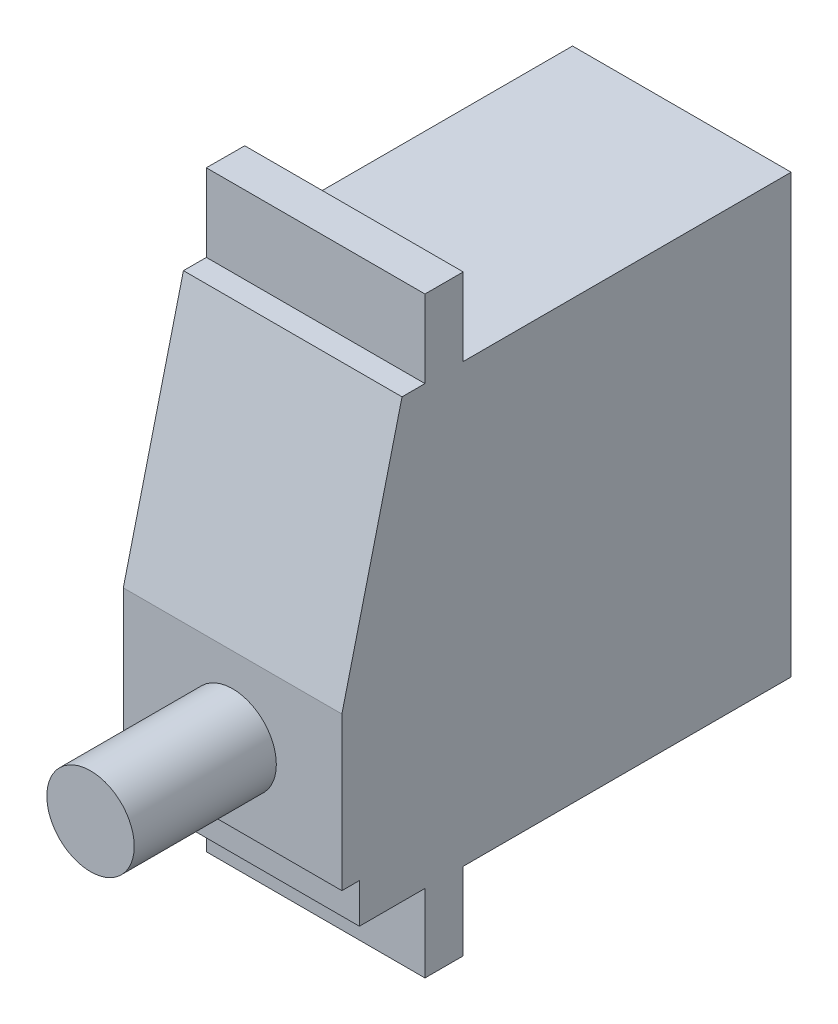
ISO-10303-21;
HEADER;
FILE_DESCRIPTION(('STEP AP214'),'2;1');
FILE_NAME('part.step','',(''),(''),'','','');
FILE_SCHEMA(('AUTOMOTIVE_DESIGN { 1 0 10303 214 1 1 1 1 }'));
ENDSEC;
DATA;
#1=APPLICATION_CONTEXT('core data for automotive mechanical design processes');
#2=APPLICATION_PROTOCOL_DEFINITION('international standard','automotive_design',2000,#1);
#3=PRODUCT_CONTEXT('',#1,'mechanical');
#4=PRODUCT('Part','Part','',(#3));
#5=PRODUCT_RELATED_PRODUCT_CATEGORY('part','',(#4));
#6=PRODUCT_DEFINITION_FORMATION('','',#4);
#7=PRODUCT_DEFINITION_CONTEXT('part definition',#1,'design');
#8=PRODUCT_DEFINITION('design','',#6,#7);
#9=PRODUCT_DEFINITION_SHAPE('','',#8);
#10=(LENGTH_UNIT() NAMED_UNIT(*) SI_UNIT(.MILLI.,.METRE.));
#11=(NAMED_UNIT(*) PLANE_ANGLE_UNIT() SI_UNIT($,.RADIAN.));
#12=(NAMED_UNIT(*) SI_UNIT($,.STERADIAN.) SOLID_ANGLE_UNIT());
#13=UNCERTAINTY_MEASURE_WITH_UNIT(LENGTH_MEASURE(1.E-05),#10,'distance_accuracy_value','');
#14=(GEOMETRIC_REPRESENTATION_CONTEXT(3) GLOBAL_UNCERTAINTY_ASSIGNED_CONTEXT((#13)) GLOBAL_UNIT_ASSIGNED_CONTEXT((#10,
#11,#12)) REPRESENTATION_CONTEXT('',''));
#15=CARTESIAN_POINT('',(0.,0.,0.));
#16=DIRECTION('',(0.,0.,1.));
#17=DIRECTION('',(1.,0.,0.));
#18=AXIS2_PLACEMENT_3D('',#15,#16,#17);
#19=CARTESIAN_POINT('',(-9.99999955296516,29.3791089206934,0.));
#20=DIRECTION('',(0.,1.,0.));
#21=DIRECTION('',(0.,0.,1.));
#22=AXIS2_PLACEMENT_3D('',#19,#20,#21);
#23=PLANE('',#22);
#24=DIRECTION('',(0.,0.,1.));
#25=VECTOR('',#24,1.);
#26=CARTESIAN_POINT('',(-9.99999955296516,29.3791089206934,0.));
#27=LINE('',#26,#25);
#28=CARTESIAN_POINT('',(-9.99999955296516,29.3791089206934,0.));
#29=VERTEX_POINT('',#28);
#30=CARTESIAN_POINT('',(-9.99999955296518,29.3791089206934,32.225966149538));
#31=VERTEX_POINT('',#30);
#32=EDGE_CURVE('E169',#29,#31,#27,.T.);
#33=ORIENTED_EDGE('',*,*,#32,.T.);
#34=DIRECTION('',(0.00392855270652036,0.,-0.999992283207042));
#35=VECTOR('',#34,1.);
#36=CARTESIAN_POINT('',(-10.0051267672293,29.3791089206934,33.5310713833168));
#37=LINE('',#36,#35);
#38=CARTESIAN_POINT('',(-9.99125465750694,29.3791089206934,29.9999993294477));
#39=VERTEX_POINT('',#38);
#40=EDGE_CURVE('E152',#31,#39,#37,.T.);
#41=ORIENTED_EDGE('',*,*,#40,.T.);
#42=DIRECTION('',(1.,0.,0.));
#43=VECTOR('',#42,1.);
#44=CARTESIAN_POINT('',(-17.9139704070891,29.3791089206934,29.9999993294477));
#45=LINE('',#44,#43);
#46=CARTESIAN_POINT('',(10.,29.3791089206934,29.9999993294477));
#47=VERTEX_POINT('',#46);
#48=EDGE_CURVE('E158',#39,#47,#45,.T.);
#49=ORIENTED_EDGE('',*,*,#48,.T.);
#50=DIRECTION('',(0.,0.,1.));
#51=VECTOR('',#50,1.);
#52=CARTESIAN_POINT('',(10.,29.3791089206934,0.));
#53=LINE('',#52,#51);
#54=CARTESIAN_POINT('',(10.,29.3791089206934,0.));
#55=VERTEX_POINT('',#54);
#56=EDGE_CURVE('E233',#55,#47,#53,.T.);
#57=ORIENTED_EDGE('',*,*,#56,.F.);
#58=DIRECTION('',(1.,0.,0.));
#59=VECTOR('',#58,1.);
#60=CARTESIAN_POINT('',(-9.99999955296516,29.3791089206934,0.));
#61=LINE('',#60,#59);
#62=EDGE_CURVE('E238',#29,#55,#61,.T.);
#63=ORIENTED_EDGE('',*,*,#62,.F.);
#64=EDGE_LOOP('',(#33,#41,#49,#57,#63));
#65=FACE_BOUND('',#64,.T.);
#66=ADVANCED_FACE('F34',(#65),#23,.T.);
#67=CARTESIAN_POINT('',(-9.99999955296516,-17.720889300108,0.));
#68=DIRECTION('',(0.,0.,-1.));
#69=DIRECTION('',(0.,1.,0.));
#70=AXIS2_PLACEMENT_3D('',#67,#68,#69);
#71=PLANE('',#70);
#72=DIRECTION('',(1.,0.,0.));
#73=VECTOR('',#72,1.);
#74=CARTESIAN_POINT('',(-9.99999955296516,-10.6208901852369,0.));
#75=LINE('',#74,#73);
#76=CARTESIAN_POINT('',(-9.99999955296516,-10.6208901852369,0.));
#77=VERTEX_POINT('',#76);
#78=CARTESIAN_POINT('',(10.,-10.6208901852369,0.));
#79=VERTEX_POINT('',#78);
#80=EDGE_CURVE('E255',#77,#79,#75,.T.);
#81=ORIENTED_EDGE('',*,*,#80,.F.);
#82=DIRECTION('',(0.,1.,0.));
#83=VECTOR('',#82,1.);
#84=CARTESIAN_POINT('',(-9.99999955296516,-17.720889300108,0.));
#85=LINE('',#84,#83);
#86=EDGE_CURVE('E231',#77,#29,#85,.T.);
#87=ORIENTED_EDGE('',*,*,#86,.T.);
#88=ORIENTED_EDGE('',*,*,#62,.T.);
#89=DIRECTION('',(0.,1.,0.));
#90=VECTOR('',#89,1.);
#91=CARTESIAN_POINT('',(10.,-17.720889300108,0.));
#92=LINE('',#91,#90);
#93=EDGE_CURVE('E253',#79,#55,#92,.T.);
#94=ORIENTED_EDGE('',*,*,#93,.F.);
#95=EDGE_LOOP('',(#81,#87,#88,#94));
#96=FACE_BOUND('',#95,.T.);
#97=ADVANCED_FACE('F333',(#96),#71,.T.);
#98=CARTESIAN_POINT('',(-9.99999955296516,-17.720889300108,41.0999990999699));
#99=DIRECTION('',(0.,-1.,0.));
#100=DIRECTION('',(0.,0.,-1.));
#101=AXIS2_PLACEMENT_3D('',#98,#99,#100);
#102=PLANE('',#101);
#103=DIRECTION('',(1.,0.,0.));
#104=VECTOR('',#103,1.);
#105=CARTESIAN_POINT('',(-9.99999955296516,-17.720889300108,33.500000834465));
#106=LINE('',#105,#104);
#107=CARTESIAN_POINT('',(-9.99999955296516,-17.720889300108,33.500000834465));
#108=VERTEX_POINT('',#107);
#109=CARTESIAN_POINT('',(10.,-17.720889300108,33.500000834465));
#110=VERTEX_POINT('',#109);
#111=EDGE_CURVE('E289',#108,#110,#106,.T.);
#112=ORIENTED_EDGE('',*,*,#111,.F.);
#113=DIRECTION('',(0.,0.,-1.));
#114=VECTOR('',#113,1.);
#115=CARTESIAN_POINT('',(-9.99999955296516,-17.720889300108,41.0999990999699));
#116=LINE('',#115,#114);
#117=CARTESIAN_POINT('',(-9.99999955296516,-17.720889300108,29.9999993294477));
#118=VERTEX_POINT('',#117);
#119=EDGE_CURVE('E240',#108,#118,#116,.T.);
#120=ORIENTED_EDGE('',*,*,#119,.T.);
#121=DIRECTION('',(1.,0.,0.));
#122=VECTOR('',#121,1.);
#123=CARTESIAN_POINT('',(-9.99999955296516,-17.720889300108,29.9999993294477));
#124=LINE('',#123,#122);
#125=CARTESIAN_POINT('',(10.,-17.720889300108,29.9999993294477));
#126=VERTEX_POINT('',#125);
#127=EDGE_CURVE('E306',#118,#126,#124,.T.);
#128=ORIENTED_EDGE('',*,*,#127,.T.);
#129=DIRECTION('',(0.,0.,-1.));
#130=VECTOR('',#129,1.);
#131=CARTESIAN_POINT('',(10.,-17.720889300108,41.0999990999699));
#132=LINE('',#131,#130);
#133=EDGE_CURVE('E229',#110,#126,#132,.T.);
#134=ORIENTED_EDGE('',*,*,#133,.F.);
#135=EDGE_LOOP('',(#112,#120,#128,#134));
#136=FACE_BOUND('',#135,.T.);
#137=ADVANCED_FACE('F206',(#136),#102,.T.);
#138=CARTESIAN_POINT('',(-9.99999955296516,7.00000021606684,41.0999990999699));
#139=DIRECTION('',(0.,0.,1.));
#140=DIRECTION('',(1.,0.,0.));
#141=AXIS2_PLACEMENT_3D('',#138,#139,#140);
#142=PLANE('',#141);
#143=CARTESIAN_POINT('',(0.,0.,41.0999990999699));
#144=DIRECTION('',(0.,0.,1.));
#145=DIRECTION('',(1.,0.,0.));
#146=AXIS2_PLACEMENT_3D('',#143,#144,#145);
#147=CIRCLE('',#146,4.);
#148=CARTESIAN_POINT('',(4.,0.,41.0999990999699));
#149=VERTEX_POINT('',#148);
#150=EDGE_CURVE('E12',#149,#149,#147,.T.);
#151=ORIENTED_EDGE('',*,*,#150,.F.);
#152=EDGE_LOOP('',(#151));
#153=FACE_BOUND('',#152,.T.);
#154=DIRECTION('',(1.,0.,0.));
#155=VECTOR('',#154,1.);
#156=CARTESIAN_POINT('',(-9.99999955296516,-7.00000021606684,41.0999990999699));
#157=LINE('',#156,#155);
#158=CARTESIAN_POINT('',(-9.99999955296516,-7.00000021606684,41.0999990999699));
#159=VERTEX_POINT('',#158);
#160=CARTESIAN_POINT('',(10.,-7.00000021606684,41.0999990999699));
#161=VERTEX_POINT('',#160);
#162=EDGE_CURVE('E211',#159,#161,#157,.T.);
#163=ORIENTED_EDGE('',*,*,#162,.T.);
#164=DIRECTION('',(0.,-1.,0.));
#165=VECTOR('',#164,1.);
#166=CARTESIAN_POINT('',(10.,7.00000021606684,41.0999990999699));
#167=LINE('',#166,#165);
#168=CARTESIAN_POINT('',(10.,7.00000021606684,41.0999990999699));
#169=VERTEX_POINT('',#168);
#170=EDGE_CURVE('E213',#169,#161,#167,.T.);
#171=ORIENTED_EDGE('',*,*,#170,.F.);
#172=DIRECTION('',(1.,0.,0.));
#173=VECTOR('',#172,1.);
#174=CARTESIAN_POINT('',(-9.99999955296516,7.00000021606684,41.0999990999699));
#175=LINE('',#174,#173);
#176=CARTESIAN_POINT('',(-9.99999955296516,7.00000021606684,41.0999990999699));
#177=VERTEX_POINT('',#176);
#178=EDGE_CURVE('E170',#177,#169,#175,.T.);
#179=ORIENTED_EDGE('',*,*,#178,.F.);
#180=DIRECTION('',(0.,-1.,0.));
#181=VECTOR('',#180,1.);
#182=CARTESIAN_POINT('',(-9.99999955296516,7.00000021606684,41.0999990999699));
#183=LINE('',#182,#181);
#184=EDGE_CURVE('E216',#177,#159,#183,.T.);
#185=ORIENTED_EDGE('',*,*,#184,.T.);
#186=EDGE_LOOP('',(#163,#171,#179,#185));
#187=FACE_BOUND('',#186,.T.);
#188=ADVANCED_FACE('F202',(#153,#187),#142,.T.);
#189=CARTESIAN_POINT('',(-9.99999955296516,29.3791089206934,35.5999991297722));
#190=DIRECTION('',(0.,0.23866292569632,0.971102470338776));
#191=DIRECTION('',(0.,-0.971102470338776,0.23866292569632));
#192=AXIS2_PLACEMENT_3D('',#189,#190,#191);
#193=PLANE('',#192);
#194=DIRECTION('',(0.,-0.971102470338776,0.23866292569632));
#195=VECTOR('',#194,1.);
#196=CARTESIAN_POINT('',(10.,29.3791089206934,35.5999991297722));
#197=LINE('',#196,#195);
#198=CARTESIAN_POINT('',(10.,29.3791089206934,35.5999991297722));
#199=VERTEX_POINT('',#198);
#200=EDGE_CURVE('E228',#199,#169,#197,.T.);
#201=ORIENTED_EDGE('',*,*,#200,.F.);
#202=DIRECTION('',(1.,0.,0.));
#203=VECTOR('',#202,1.);
#204=CARTESIAN_POINT('',(-9.99999955296516,29.3791089206934,35.5999991297722));
#205=LINE('',#204,#203);
#206=CARTESIAN_POINT('',(-9.99999955296516,29.3791089206934,35.5999991297722));
#207=VERTEX_POINT('',#206);
#208=EDGE_CURVE('E174',#207,#199,#205,.T.);
#209=ORIENTED_EDGE('',*,*,#208,.F.);
#210=DIRECTION('',(0.,-0.971102470338776,0.23866292569632));
#211=VECTOR('',#210,1.);
#212=CARTESIAN_POINT('',(-9.99999955296516,29.3791089206934,35.5999991297722));
#213=LINE('',#212,#211);
#214=EDGE_CURVE('E249',#207,#177,#213,.T.);
#215=ORIENTED_EDGE('',*,*,#214,.T.);
#216=ORIENTED_EDGE('',*,*,#178,.T.);
#217=EDGE_LOOP('',(#201,#209,#215,#216));
#218=FACE_BOUND('',#217,.T.);
#219=ADVANCED_FACE('F205',(#218),#193,.T.);
#220=DIRECTION('',(1.,0.,0.));
#221=VECTOR('',#220,1.);
#222=CARTESIAN_POINT('',(-17.9139704070891,29.3791089206934,33.500000834465));
#223=LINE('',#222,#221);
#224=CARTESIAN_POINT('',(-9.99999955296516,29.3791089206934,33.500000834465));
#225=VERTEX_POINT('',#224);
#226=CARTESIAN_POINT('',(10.,29.3791089206934,33.500000834465));
#227=VERTEX_POINT('',#226);
#228=EDGE_CURVE('E43',#225,#227,#223,.T.);
#229=ORIENTED_EDGE('',*,*,#228,.F.);
#230=EDGE_CURVE('E261',#225,#207,#27,.T.);
#231=ORIENTED_EDGE('',*,*,#230,.T.);
#232=ORIENTED_EDGE('',*,*,#208,.T.);
#233=EDGE_CURVE('E254',#227,#199,#53,.T.);
#234=ORIENTED_EDGE('',*,*,#233,.F.);
#235=EDGE_LOOP('',(#229,#231,#232,#234));
#236=FACE_BOUND('',#235,.T.);
#237=ADVANCED_FACE('F259',(#236),#23,.T.);
#238=CARTESIAN_POINT('',(-9.99999955296516,0.,0.));
#239=DIRECTION('',(1.,0.,0.));
#240=DIRECTION('',(0.,0.,-1.));
#241=AXIS2_PLACEMENT_3D('',#238,#239,#240);
#242=PLANE('',#241);
#243=DIRECTION('',(0.,0.,1.));
#244=VECTOR('',#243,1.);
#245=CARTESIAN_POINT('',(-9.99999955296516,-10.6208901852369,33.500000834465));
#246=LINE('',#245,#244);
#247=CARTESIAN_POINT('',(-9.99999955296516,-10.6208901852369,33.500000834465));
#248=VERTEX_POINT('',#247);
#249=CARTESIAN_POINT('',(-9.99999955296516,-10.6208901852369,39.5000018179417));
#250=VERTEX_POINT('',#249);
#251=EDGE_CURVE('E282',#248,#250,#246,.T.);
#252=ORIENTED_EDGE('',*,*,#251,.T.);
#253=DIRECTION('',(0.,1.,0.));
#254=VECTOR('',#253,1.);
#255=CARTESIAN_POINT('',(-9.99999955296516,-10.6208901852369,39.5000018179417));
#256=LINE('',#255,#254);
#257=CARTESIAN_POINT('',(-9.99999955296516,-7.00000021606684,39.5000018179417));
#258=VERTEX_POINT('',#257);
#259=EDGE_CURVE('E59',#250,#258,#256,.T.);
#260=ORIENTED_EDGE('',*,*,#259,.T.);
#261=DIRECTION('',(0.,0.,1.));
#262=VECTOR('',#261,1.);
#263=CARTESIAN_POINT('',(-9.99999955296516,-7.00000021606684,39.5000018179417));
#264=LINE('',#263,#262);
#265=EDGE_CURVE('E268',#258,#159,#264,.T.);
#266=ORIENTED_EDGE('',*,*,#265,.T.);
#267=ORIENTED_EDGE('',*,*,#184,.F.);
#268=ORIENTED_EDGE('',*,*,#214,.F.);
#269=ORIENTED_EDGE('',*,*,#230,.F.);
#270=EDGE_CURVE('E311',#31,#225,#27,.T.);
#271=ORIENTED_EDGE('',*,*,#270,.F.);
#272=ORIENTED_EDGE('',*,*,#32,.F.);
#273=ORIENTED_EDGE('',*,*,#86,.F.);
#274=DIRECTION('',(0.,0.,1.));
#275=VECTOR('',#274,1.);
#276=CARTESIAN_POINT('',(-9.99999955296516,-10.6208901852369,0.));
#277=LINE('',#276,#275);
#278=CARTESIAN_POINT('',(-9.99999955296516,-10.6208901852369,29.9999993294477));
#279=VERTEX_POINT('',#278);
#280=EDGE_CURVE('E294',#77,#279,#277,.T.);
#281=ORIENTED_EDGE('',*,*,#280,.T.);
#282=DIRECTION('',(0.,-1.,0.));
#283=VECTOR('',#282,1.);
#284=CARTESIAN_POINT('',(-9.99999955296516,-10.6208901852369,29.9999993294477));
#285=LINE('',#284,#283);
#286=EDGE_CURVE('E297',#279,#118,#285,.T.);
#287=ORIENTED_EDGE('',*,*,#286,.T.);
#288=ORIENTED_EDGE('',*,*,#119,.F.);
#289=DIRECTION('',(0.,1.,0.));
#290=VECTOR('',#289,1.);
#291=CARTESIAN_POINT('',(-9.99999955296516,-17.720889300108,33.500000834465));
#292=LINE('',#291,#290);
#293=EDGE_CURVE('E279',#108,#248,#292,.T.);
#294=ORIENTED_EDGE('',*,*,#293,.T.);
#295=EDGE_LOOP('',(#252,#260,#266,#267,#268,#269,#271,#272,#273,#281,#287,#288,#294));
#296=FACE_BOUND('',#295,.T.);
#297=ADVANCED_FACE('F267',(#296),#242,.F.);
#298=CARTESIAN_POINT('',(10.,0.,0.));
#299=DIRECTION('',(1.,0.,0.));
#300=DIRECTION('',(0.,0.,-1.));
#301=AXIS2_PLACEMENT_3D('',#298,#299,#300);
#302=PLANE('',#301);
#303=DIRECTION('',(0.,1.,0.));
#304=VECTOR('',#303,1.);
#305=CARTESIAN_POINT('',(10.,-10.6208901852369,39.5000018179417));
#306=LINE('',#305,#304);
#307=CARTESIAN_POINT('',(10.,-10.6208901852369,39.5000018179417));
#308=VERTEX_POINT('',#307);
#309=CARTESIAN_POINT('',(10.,-7.00000021606684,39.5000018179417));
#310=VERTEX_POINT('',#309);
#311=EDGE_CURVE('E273',#308,#310,#306,.T.);
#312=ORIENTED_EDGE('',*,*,#311,.F.);
#313=DIRECTION('',(0.,0.,1.));
#314=VECTOR('',#313,1.);
#315=CARTESIAN_POINT('',(10.,-10.6208901852369,33.500000834465));
#316=LINE('',#315,#314);
#317=CARTESIAN_POINT('',(10.,-10.6208901852369,33.500000834465));
#318=VERTEX_POINT('',#317);
#319=EDGE_CURVE('E283',#318,#308,#316,.T.);
#320=ORIENTED_EDGE('',*,*,#319,.F.);
#321=DIRECTION('',(0.,1.,0.));
#322=VECTOR('',#321,1.);
#323=CARTESIAN_POINT('',(10.,-17.720889300108,33.500000834465));
#324=LINE('',#323,#322);
#325=EDGE_CURVE('E277',#110,#318,#324,.T.);
#326=ORIENTED_EDGE('',*,*,#325,.F.);
#327=ORIENTED_EDGE('',*,*,#133,.T.);
#328=DIRECTION('',(0.,-1.,0.));
#329=VECTOR('',#328,1.);
#330=CARTESIAN_POINT('',(10.,-10.6208901852369,29.9999993294477));
#331=LINE('',#330,#329);
#332=CARTESIAN_POINT('',(10.,-10.6208901852369,29.9999993294477));
#333=VERTEX_POINT('',#332);
#334=EDGE_CURVE('E298',#333,#126,#331,.T.);
#335=ORIENTED_EDGE('',*,*,#334,.F.);
#336=DIRECTION('',(0.,0.,1.));
#337=VECTOR('',#336,1.);
#338=CARTESIAN_POINT('',(10.,-10.6208901852369,0.));
#339=LINE('',#338,#337);
#340=EDGE_CURVE('E291',#79,#333,#339,.T.);
#341=ORIENTED_EDGE('',*,*,#340,.F.);
#342=ORIENTED_EDGE('',*,*,#93,.T.);
#343=ORIENTED_EDGE('',*,*,#56,.T.);
#344=DIRECTION('',(0.,1.,0.));
#345=VECTOR('',#344,1.);
#346=CARTESIAN_POINT('',(10.,29.3791089206934,29.9999993294477));
#347=LINE('',#346,#345);
#348=CARTESIAN_POINT('',(10.,36.4791117608547,29.9999993294477));
#349=VERTEX_POINT('',#348);
#350=EDGE_CURVE('E51',#47,#349,#347,.T.);
#351=ORIENTED_EDGE('',*,*,#350,.T.);
#352=DIRECTION('',(0.,0.,1.));
#353=VECTOR('',#352,1.);
#354=CARTESIAN_POINT('',(10.,36.4791117608547,29.9999993294477));
#355=LINE('',#354,#353);
#356=CARTESIAN_POINT('',(10.,36.4791117608547,33.500000834465));
#357=VERTEX_POINT('',#356);
#358=EDGE_CURVE('E178',#349,#357,#355,.T.);
#359=ORIENTED_EDGE('',*,*,#358,.T.);
#360=DIRECTION('',(0.,-1.,0.));
#361=VECTOR('',#360,1.);
#362=CARTESIAN_POINT('',(10.,36.4791117608547,33.500000834465));
#363=LINE('',#362,#361);
#364=EDGE_CURVE('E187',#357,#227,#363,.T.);
#365=ORIENTED_EDGE('',*,*,#364,.T.);
#366=ORIENTED_EDGE('',*,*,#233,.T.);
#367=ORIENTED_EDGE('',*,*,#200,.T.);
#368=ORIENTED_EDGE('',*,*,#170,.T.);
#369=DIRECTION('',(0.,0.,1.));
#370=VECTOR('',#369,1.);
#371=CARTESIAN_POINT('',(10.,-7.00000021606684,39.5000018179417));
#372=LINE('',#371,#370);
#373=EDGE_CURVE('E226',#310,#161,#372,.T.);
#374=ORIENTED_EDGE('',*,*,#373,.F.);
#375=EDGE_LOOP('',(#312,#320,#326,#327,#335,#341,#342,#343,#351,#359,#365,#366,#367,#368,#374));
#376=FACE_BOUND('',#375,.T.);
#377=ADVANCED_FACE('F225',(#376),#302,.T.);
#378=CARTESIAN_POINT('',(-9.99999955296516,-10.6208901852369,0.));
#379=DIRECTION('',(0.,1.,0.));
#380=DIRECTION('',(0.,0.,1.));
#381=AXIS2_PLACEMENT_3D('',#378,#379,#380);
#382=PLANE('',#381);
#383=ORIENTED_EDGE('',*,*,#340,.T.);
#384=DIRECTION('',(1.,0.,0.));
#385=VECTOR('',#384,1.);
#386=CARTESIAN_POINT('',(-9.99999955296516,-10.6208901852369,29.9999993294477));
#387=LINE('',#386,#385);
#388=EDGE_CURVE('E301',#279,#333,#387,.T.);
#389=ORIENTED_EDGE('',*,*,#388,.F.);
#390=ORIENTED_EDGE('',*,*,#280,.F.);
#391=ORIENTED_EDGE('',*,*,#80,.T.);
#392=EDGE_LOOP('',(#383,#389,#390,#391));
#393=FACE_BOUND('',#392,.T.);
#394=ADVANCED_FACE('F351',(#393),#382,.F.);
#395=CARTESIAN_POINT('',(-9.99999955296516,-10.6208901852369,29.9999993294477));
#396=DIRECTION('',(0.,0.,1.));
#397=DIRECTION('',(1.,0.,0.));
#398=AXIS2_PLACEMENT_3D('',#395,#396,#397);
#399=PLANE('',#398);
#400=ORIENTED_EDGE('',*,*,#334,.T.);
#401=ORIENTED_EDGE('',*,*,#127,.F.);
#402=ORIENTED_EDGE('',*,*,#286,.F.);
#403=ORIENTED_EDGE('',*,*,#388,.T.);
#404=EDGE_LOOP('',(#400,#401,#402,#403));
#405=FACE_BOUND('',#404,.T.);
#406=ADVANCED_FACE('F355',(#405),#399,.F.);
#407=CARTESIAN_POINT('',(-9.99999955296516,-17.720889300108,33.500000834465));
#408=DIRECTION('',(0.,0.,-1.));
#409=DIRECTION('',(-1.,0.,0.));
#410=AXIS2_PLACEMENT_3D('',#407,#408,#409);
#411=PLANE('',#410);
#412=ORIENTED_EDGE('',*,*,#325,.T.);
#413=DIRECTION('',(1.,0.,0.));
#414=VECTOR('',#413,1.);
#415=CARTESIAN_POINT('',(-9.99999955296516,-10.6208901852369,33.500000834465));
#416=LINE('',#415,#414);
#417=EDGE_CURVE('E285',#248,#318,#416,.T.);
#418=ORIENTED_EDGE('',*,*,#417,.F.);
#419=ORIENTED_EDGE('',*,*,#293,.F.);
#420=ORIENTED_EDGE('',*,*,#111,.T.);
#421=EDGE_LOOP('',(#412,#418,#419,#420));
#422=FACE_BOUND('',#421,.T.);
#423=ADVANCED_FACE('F359',(#422),#411,.F.);
#424=CARTESIAN_POINT('',(-9.99999955296516,-10.6208901852369,33.500000834465));
#425=DIRECTION('',(0.,1.,0.));
#426=DIRECTION('',(0.,0.,1.));
#427=AXIS2_PLACEMENT_3D('',#424,#425,#426);
#428=PLANE('',#427);
#429=ORIENTED_EDGE('',*,*,#319,.T.);
#430=DIRECTION('',(1.,0.,0.));
#431=VECTOR('',#430,1.);
#432=CARTESIAN_POINT('',(-9.99999955296516,-10.6208901852369,39.5000018179417));
#433=LINE('',#432,#431);
#434=EDGE_CURVE('E220',#250,#308,#433,.T.);
#435=ORIENTED_EDGE('',*,*,#434,.F.);
#436=ORIENTED_EDGE('',*,*,#251,.F.);
#437=ORIENTED_EDGE('',*,*,#417,.T.);
#438=EDGE_LOOP('',(#429,#435,#436,#437));
#439=FACE_BOUND('',#438,.T.);
#440=ADVANCED_FACE('F363',(#439),#428,.F.);
#441=CARTESIAN_POINT('',(-9.99999955296516,-10.6208901852369,39.5000018179417));
#442=DIRECTION('',(0.,0.,-1.));
#443=DIRECTION('',(-1.,0.,0.));
#444=AXIS2_PLACEMENT_3D('',#441,#442,#443);
#445=PLANE('',#444);
#446=ORIENTED_EDGE('',*,*,#311,.T.);
#447=DIRECTION('',(1.,0.,0.));
#448=VECTOR('',#447,1.);
#449=CARTESIAN_POINT('',(-9.99999955296516,-7.00000021606684,39.5000018179417));
#450=LINE('',#449,#448);
#451=EDGE_CURVE('E221',#258,#310,#450,.T.);
#452=ORIENTED_EDGE('',*,*,#451,.F.);
#453=ORIENTED_EDGE('',*,*,#259,.F.);
#454=ORIENTED_EDGE('',*,*,#434,.T.);
#455=EDGE_LOOP('',(#446,#452,#453,#454));
#456=FACE_BOUND('',#455,.T.);
#457=ADVANCED_FACE('F367',(#456),#445,.F.);
#458=CARTESIAN_POINT('',(-9.99999955296516,-7.00000021606684,39.5000018179417));
#459=DIRECTION('',(0.,1.,0.));
#460=DIRECTION('',(0.,0.,1.));
#461=AXIS2_PLACEMENT_3D('',#458,#459,#460);
#462=PLANE('',#461);
#463=ORIENTED_EDGE('',*,*,#373,.T.);
#464=ORIENTED_EDGE('',*,*,#162,.F.);
#465=ORIENTED_EDGE('',*,*,#265,.F.);
#466=ORIENTED_EDGE('',*,*,#451,.T.);
#467=EDGE_LOOP('',(#463,#464,#465,#466));
#468=FACE_BOUND('',#467,.T.);
#469=ADVANCED_FACE('F371',(#468),#462,.F.);
#470=CARTESIAN_POINT('',(-9.87324478812824,0.,-0.0387878618524385));
#471=DIRECTION('',(-0.999992283207042,0.,-0.00392855270652036));
#472=DIRECTION('',(-0.00392855270652036,0.,0.999992283207042));
#473=AXIS2_PLACEMENT_3D('',#470,#471,#472);
#474=PLANE('',#473);
#475=DIRECTION('',(0.,-1.,0.));
#476=VECTOR('',#475,1.);
#477=CARTESIAN_POINT('',(-10.0050047039986,36.4791117608547,33.500000834465));
#478=LINE('',#477,#476);
#479=CARTESIAN_POINT('',(-10.0050047039986,36.4791117608547,33.500000834465));
#480=VERTEX_POINT('',#479);
#481=CARTESIAN_POINT('',(-10.0050047039986,29.3791089206934,33.500000834465));
#482=VERTEX_POINT('',#481);
#483=EDGE_CURVE('E317',#480,#482,#478,.T.);
#484=ORIENTED_EDGE('',*,*,#483,.F.);
#485=DIRECTION('',(-0.00392855270652036,0.,0.999992283207042));
#486=VECTOR('',#485,1.);
#487=CARTESIAN_POINT('',(-9.99137693294937,36.4791117608547,30.0311238956651));
#488=LINE('',#487,#486);
#489=CARTESIAN_POINT('',(-9.99125465750694,36.4791117608547,29.9999993294477));
#490=VERTEX_POINT('',#489);
#491=EDGE_CURVE('E155',#490,#480,#488,.T.);
#492=ORIENTED_EDGE('',*,*,#491,.F.);
#493=DIRECTION('',(0.,1.,0.));
#494=VECTOR('',#493,1.);
#495=CARTESIAN_POINT('',(-9.99125465750694,29.3791089206934,29.9999993294477));
#496=LINE('',#495,#494);
#497=EDGE_CURVE('E149',#39,#490,#496,.T.);
#498=ORIENTED_EDGE('',*,*,#497,.F.);
#499=ORIENTED_EDGE('',*,*,#40,.F.);
#500=EDGE_CURVE('E164',#482,#31,#37,.T.);
#501=ORIENTED_EDGE('',*,*,#500,.F.);
#502=EDGE_LOOP('',(#484,#492,#498,#499,#501));
#503=FACE_BOUND('',#502,.T.);
#504=ADVANCED_FACE('F150',(#503),#474,.T.);
#505=CARTESIAN_POINT('',(-17.9139704070891,29.3791089206934,33.500000834465));
#506=DIRECTION('',(0.,-1.,0.));
#507=DIRECTION('',(0.,0.,-1.));
#508=AXIS2_PLACEMENT_3D('',#505,#506,#507);
#509=PLANE('',#508);
#510=ORIENTED_EDGE('',*,*,#500,.T.);
#511=ORIENTED_EDGE('',*,*,#270,.T.);
#512=EDGE_CURVE('E173',#482,#225,#223,.T.);
#513=ORIENTED_EDGE('',*,*,#512,.F.);
#514=EDGE_LOOP('',(#510,#511,#513));
#515=FACE_BOUND('',#514,.T.);
#516=ADVANCED_FACE('F313',(#515),#509,.T.);
#517=CARTESIAN_POINT('',(-17.9139704070891,29.3791089206934,29.9999993294477));
#518=DIRECTION('',(0.,0.,-1.));
#519=DIRECTION('',(-1.,0.,0.));
#520=AXIS2_PLACEMENT_3D('',#517,#518,#519);
#521=PLANE('',#520);
#522=ORIENTED_EDGE('',*,*,#48,.F.);
#523=ORIENTED_EDGE('',*,*,#497,.T.);
#524=DIRECTION('',(1.,0.,0.));
#525=VECTOR('',#524,1.);
#526=CARTESIAN_POINT('',(-17.9139704070891,36.4791117608547,29.9999993294477));
#527=LINE('',#526,#525);
#528=EDGE_CURVE('E157',#490,#349,#527,.T.);
#529=ORIENTED_EDGE('',*,*,#528,.T.);
#530=ORIENTED_EDGE('',*,*,#350,.F.);
#531=EDGE_LOOP('',(#522,#523,#529,#530));
#532=FACE_BOUND('',#531,.T.);
#533=ADVANCED_FACE('F160',(#532),#521,.T.);
#534=CARTESIAN_POINT('',(-17.9139704070891,36.4791117608547,29.9999993294477));
#535=DIRECTION('',(0.,1.,0.));
#536=DIRECTION('',(0.,0.,1.));
#537=AXIS2_PLACEMENT_3D('',#534,#535,#536);
#538=PLANE('',#537);
#539=ORIENTED_EDGE('',*,*,#528,.F.);
#540=ORIENTED_EDGE('',*,*,#491,.T.);
#541=DIRECTION('',(1.,0.,0.));
#542=VECTOR('',#541,1.);
#543=CARTESIAN_POINT('',(-17.9139704070891,36.4791117608547,33.500000834465));
#544=LINE('',#543,#542);
#545=EDGE_CURVE('E318',#480,#357,#544,.T.);
#546=ORIENTED_EDGE('',*,*,#545,.T.);
#547=ORIENTED_EDGE('',*,*,#358,.F.);
#548=EDGE_LOOP('',(#539,#540,#546,#547));
#549=FACE_BOUND('',#548,.T.);
#550=ADVANCED_FACE('F323',(#549),#538,.T.);
#551=CARTESIAN_POINT('',(-17.9139704070891,36.4791117608547,33.500000834465));
#552=DIRECTION('',(0.,0.,1.));
#553=DIRECTION('',(1.,0.,0.));
#554=AXIS2_PLACEMENT_3D('',#551,#552,#553);
#555=PLANE('',#554);
#556=ORIENTED_EDGE('',*,*,#545,.F.);
#557=ORIENTED_EDGE('',*,*,#483,.T.);
#558=ORIENTED_EDGE('',*,*,#512,.T.);
#559=ORIENTED_EDGE('',*,*,#228,.T.);
#560=ORIENTED_EDGE('',*,*,#364,.F.);
#561=EDGE_LOOP('',(#556,#557,#558,#559,#560));
#562=FACE_BOUND('',#561,.T.);
#563=ADVANCED_FACE('F198',(#562),#555,.T.);
#564=CARTESIAN_POINT('',(0.,0.,48.0999990999699));
#565=DIRECTION('',(0.,0.,-1.));
#566=DIRECTION('',(-1.,0.,0.));
#567=AXIS2_PLACEMENT_3D('',#564,#565,#566);
#568=CYLINDRICAL_SURFACE('',#567,4.);
#569=CARTESIAN_POINT('',(0.,0.,54.0999990999699));
#570=DIRECTION('',(0.,0.,1.));
#571=DIRECTION('',(1.,0.,0.));
#572=AXIS2_PLACEMENT_3D('',#569,#570,#571);
#573=CIRCLE('',#572,4.);
#574=CARTESIAN_POINT('',(4.,0.,54.0999990999699));
#575=VERTEX_POINT('',#574);
#576=EDGE_CURVE('E38',#575,#575,#573,.T.);
#577=ORIENTED_EDGE('',*,*,#576,.F.);
#578=EDGE_LOOP('',(#577));
#579=FACE_BOUND('',#578,.T.);
#580=ORIENTED_EDGE('',*,*,#150,.T.);
#581=EDGE_LOOP('',(#580));
#582=FACE_BOUND('',#581,.T.);
#583=ADVANCED_FACE('F195',(#579,#582),#568,.T.);
#584=CARTESIAN_POINT('',(0.,0.,54.0999990999699));
#585=DIRECTION('',(0.,0.,1.));
#586=DIRECTION('',(1.,0.,0.));
#587=AXIS2_PLACEMENT_3D('',#584,#585,#586);
#588=PLANE('',#587);
#589=ORIENTED_EDGE('',*,*,#576,.T.);
#590=EDGE_LOOP('',(#589));
#591=FACE_BOUND('',#590,.T.);
#592=ADVANCED_FACE('F36',(#591),#588,.T.);
#593=CLOSED_SHELL('',(#66,#97,#137,#188,#219,#237,#297,#377,#394,#406,#423,#440,#457,#469,#504,
#516,#533,#550,#563,#583,#592));
#594=MANIFOLD_SOLID_BREP('B2',#593);
#595=ADVANCED_BREP_SHAPE_REPRESENTATION('',(#18,#594),#14);
#596=SHAPE_DEFINITION_REPRESENTATION(#9,#595);
ENDSEC;
END-ISO-10303-21;
